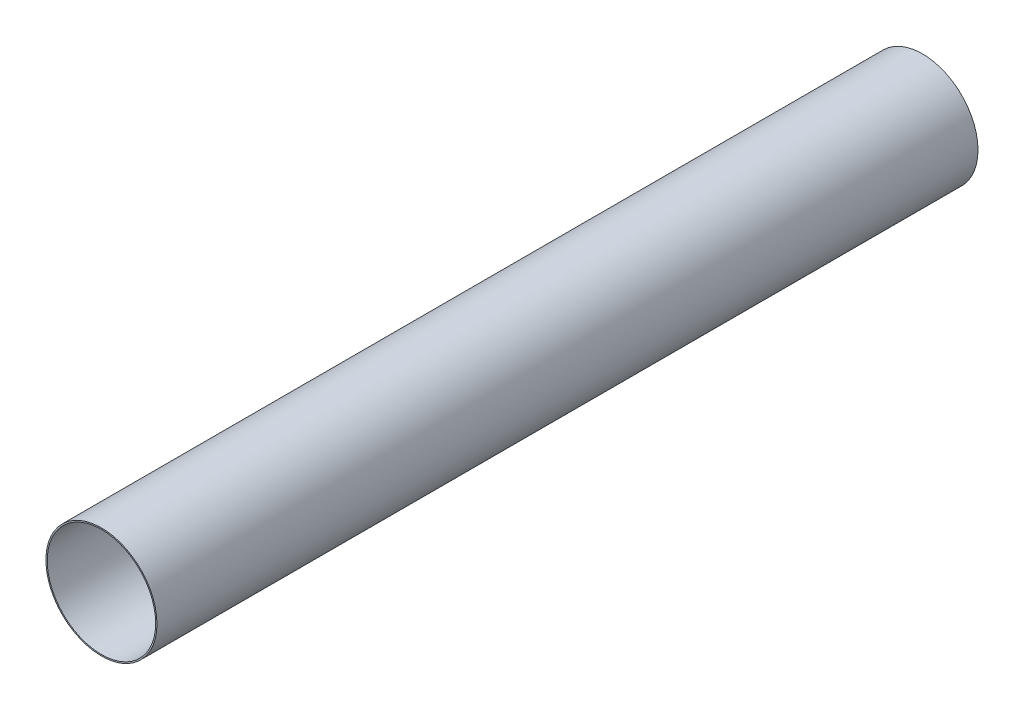
ISO-10303-21;
HEADER;
FILE_DESCRIPTION(('STEP AP214'),'2;1');
FILE_NAME('part.step','',(''),(''),'','','');
FILE_SCHEMA(('AUTOMOTIVE_DESIGN { 1 0 10303 214 1 1 1 1 }'));
ENDSEC;
DATA;
#1=APPLICATION_CONTEXT('core data for automotive mechanical design processes');
#2=APPLICATION_PROTOCOL_DEFINITION('international standard','automotive_design',2000,#1);
#3=PRODUCT_CONTEXT('',#1,'mechanical');
#4=PRODUCT('Part','Part','',(#3));
#5=PRODUCT_RELATED_PRODUCT_CATEGORY('part','',(#4));
#6=PRODUCT_DEFINITION_FORMATION('','',#4);
#7=PRODUCT_DEFINITION_CONTEXT('part definition',#1,'design');
#8=PRODUCT_DEFINITION('design','',#6,#7);
#9=PRODUCT_DEFINITION_SHAPE('','',#8);
#10=(LENGTH_UNIT() NAMED_UNIT(*) SI_UNIT(.MILLI.,.METRE.));
#11=(NAMED_UNIT(*) PLANE_ANGLE_UNIT() SI_UNIT($,.RADIAN.));
#12=(NAMED_UNIT(*) SI_UNIT($,.STERADIAN.) SOLID_ANGLE_UNIT());
#13=UNCERTAINTY_MEASURE_WITH_UNIT(LENGTH_MEASURE(1.E-05),#10,'distance_accuracy_value','');
#14=(GEOMETRIC_REPRESENTATION_CONTEXT(3) GLOBAL_UNCERTAINTY_ASSIGNED_CONTEXT((#13)) GLOBAL_UNIT_ASSIGNED_CONTEXT((#10,
#11,#12)) REPRESENTATION_CONTEXT('',''));
#15=CARTESIAN_POINT('',(0.,0.,0.));
#16=DIRECTION('',(0.,0.,1.));
#17=DIRECTION('',(1.,0.,0.));
#18=AXIS2_PLACEMENT_3D('',#15,#16,#17);
#19=CARTESIAN_POINT('',(0.,0.,625.));
#20=DIRECTION('',(0.,0.,1.));
#21=DIRECTION('',(1.,0.,0.));
#22=AXIS2_PLACEMENT_3D('',#19,#20,#21);
#23=PLANE('',#22);
#24=CARTESIAN_POINT('',(0.,0.,625.));
#25=DIRECTION('',(0.,0.,1.));
#26=DIRECTION('',(1.,0.,0.));
#27=AXIS2_PLACEMENT_3D('',#24,#25,#26);
#28=CIRCLE('',#27,84.55);
#29=CARTESIAN_POINT('',(84.55,0.,625.));
#30=VERTEX_POINT('',#29);
#31=EDGE_CURVE('E12',#30,#30,#28,.T.);
#32=ORIENTED_EDGE('',*,*,#31,.T.);
#33=EDGE_LOOP('',(#32));
#34=FACE_BOUND('',#33,.T.);
#35=CARTESIAN_POINT('',(0.,0.,625.));
#36=DIRECTION('',(0.,0.,1.));
#37=DIRECTION('',(1.,0.,0.));
#38=AXIS2_PLACEMENT_3D('',#35,#36,#37);
#39=CIRCLE('',#38,82.55);
#40=CARTESIAN_POINT('',(82.55,0.,625.));
#41=VERTEX_POINT('',#40);
#42=EDGE_CURVE('E52',#41,#41,#39,.T.);
#43=ORIENTED_EDGE('',*,*,#42,.F.);
#44=EDGE_LOOP('',(#43));
#45=FACE_BOUND('',#44,.T.);
#46=ADVANCED_FACE('F41',(#34,#45),#23,.T.);
#47=CARTESIAN_POINT('',(0.,0.,-625.));
#48=DIRECTION('',(0.,0.,1.));
#49=DIRECTION('',(1.,0.,0.));
#50=AXIS2_PLACEMENT_3D('',#47,#48,#49);
#51=PLANE('',#50);
#52=CARTESIAN_POINT('',(0.,0.,-625.));
#53=DIRECTION('',(0.,0.,1.));
#54=DIRECTION('',(1.,0.,0.));
#55=AXIS2_PLACEMENT_3D('',#52,#53,#54);
#56=CIRCLE('',#55,84.55);
#57=CARTESIAN_POINT('',(84.55,0.,-625.));
#58=VERTEX_POINT('',#57);
#59=EDGE_CURVE('E45',#58,#58,#56,.T.);
#60=ORIENTED_EDGE('',*,*,#59,.F.);
#61=EDGE_LOOP('',(#60));
#62=FACE_BOUND('',#61,.T.);
#63=CARTESIAN_POINT('',(0.,0.,-625.));
#64=DIRECTION('',(0.,0.,1.));
#65=DIRECTION('',(1.,0.,0.));
#66=AXIS2_PLACEMENT_3D('',#63,#64,#65);
#67=CIRCLE('',#66,82.55);
#68=CARTESIAN_POINT('',(82.55,0.,-625.));
#69=VERTEX_POINT('',#68);
#70=EDGE_CURVE('E54',#69,#69,#67,.T.);
#71=ORIENTED_EDGE('',*,*,#70,.T.);
#72=EDGE_LOOP('',(#71));
#73=FACE_BOUND('',#72,.T.);
#74=ADVANCED_FACE('F64',(#62,#73),#51,.F.);
#75=CARTESIAN_POINT('',(0.,0.,625.));
#76=DIRECTION('',(0.,0.,-1.));
#77=DIRECTION('',(-1.,0.,0.));
#78=AXIS2_PLACEMENT_3D('',#75,#76,#77);
#79=CYLINDRICAL_SURFACE('',#78,84.55);
#80=ORIENTED_EDGE('',*,*,#31,.F.);
#81=EDGE_LOOP('',(#80));
#82=FACE_BOUND('',#81,.T.);
#83=ORIENTED_EDGE('',*,*,#59,.T.);
#84=EDGE_LOOP('',(#83));
#85=FACE_BOUND('',#84,.T.);
#86=ADVANCED_FACE('F43',(#82,#85),#79,.T.);
#87=CARTESIAN_POINT('',(0.,0.,625.));
#88=DIRECTION('',(0.,0.,-1.));
#89=DIRECTION('',(-1.,0.,0.));
#90=AXIS2_PLACEMENT_3D('',#87,#88,#89);
#91=CYLINDRICAL_SURFACE('',#90,82.55);
#92=ORIENTED_EDGE('',*,*,#42,.T.);
#93=EDGE_LOOP('',(#92));
#94=FACE_BOUND('',#93,.T.);
#95=ORIENTED_EDGE('',*,*,#70,.F.);
#96=EDGE_LOOP('',(#95));
#97=FACE_BOUND('',#96,.T.);
#98=ADVANCED_FACE('F60',(#94,#97),#91,.F.);
#99=CLOSED_SHELL('',(#46,#74,#86,#98));
#100=MANIFOLD_SOLID_BREP('B2',#99);
#101=ADVANCED_BREP_SHAPE_REPRESENTATION('',(#18,#100),#14);
#102=SHAPE_DEFINITION_REPRESENTATION(#9,#101);
ENDSEC;
END-ISO-10303-21;
